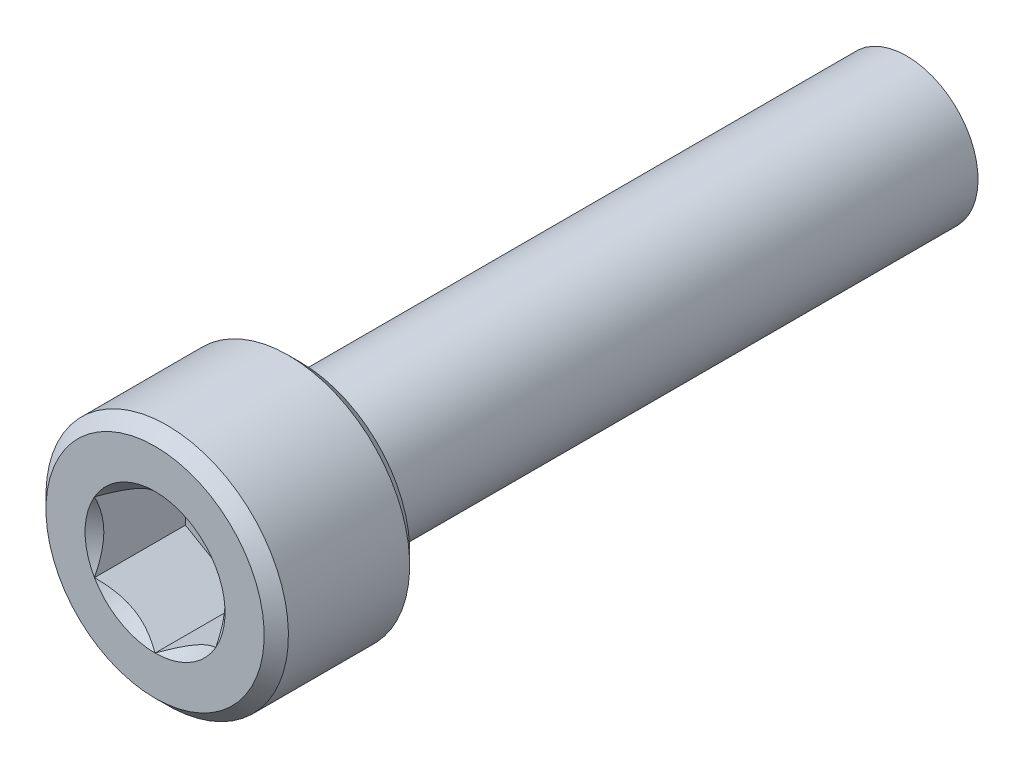
ISO-10303-21;
HEADER;
FILE_DESCRIPTION(('STEP AP214'),'2;1');
FILE_NAME('part.step','',(''),(''),'','','');
FILE_SCHEMA(('AUTOMOTIVE_DESIGN { 1 0 10303 214 1 1 1 1 }'));
ENDSEC;
DATA;
#1=APPLICATION_CONTEXT('core data for automotive mechanical design processes');
#2=APPLICATION_PROTOCOL_DEFINITION('international standard','automotive_design',2000,#1);
#3=PRODUCT_CONTEXT('',#1,'mechanical');
#4=PRODUCT('Part','Part','',(#3));
#5=PRODUCT_RELATED_PRODUCT_CATEGORY('part','',(#4));
#6=PRODUCT_DEFINITION_FORMATION('','',#4);
#7=PRODUCT_DEFINITION_CONTEXT('part definition',#1,'design');
#8=PRODUCT_DEFINITION('design','',#6,#7);
#9=PRODUCT_DEFINITION_SHAPE('','',#8);
#10=(LENGTH_UNIT() NAMED_UNIT(*) SI_UNIT(.MILLI.,.METRE.));
#11=(NAMED_UNIT(*) PLANE_ANGLE_UNIT() SI_UNIT($,.RADIAN.));
#12=(NAMED_UNIT(*) SI_UNIT($,.STERADIAN.) SOLID_ANGLE_UNIT());
#13=UNCERTAINTY_MEASURE_WITH_UNIT(LENGTH_MEASURE(1.E-05),#10,'distance_accuracy_value','');
#14=(GEOMETRIC_REPRESENTATION_CONTEXT(3) GLOBAL_UNCERTAINTY_ASSIGNED_CONTEXT((#13)) GLOBAL_UNIT_ASSIGNED_CONTEXT((#10,
#11,#12)) REPRESENTATION_CONTEXT('',''));
#15=CARTESIAN_POINT('',(0.,0.,0.));
#16=DIRECTION('',(0.,0.,1.));
#17=DIRECTION('',(1.,0.,0.));
#18=AXIS2_PLACEMENT_3D('',#15,#16,#17);
#19=CARTESIAN_POINT('',(2.5,-4.33012701892219,2.25));
#20=DIRECTION('',(0.,0.,1.));
#21=DIRECTION('',(0.,-1.,0.));
#22=AXIS2_PLACEMENT_3D('',#19,#20,#21);
#23=PLANE('',#22);
#24=DIRECTION('',(-0.866025403784439,-0.5,0.));
#25=VECTOR('',#24,1.);
#26=CARTESIAN_POINT('',(0.,2.88675134594813,2.25));
#27=LINE('',#26,#25);
#28=CARTESIAN_POINT('',(0.,2.88675134594813,2.25));
#29=VERTEX_POINT('',#28);
#30=CARTESIAN_POINT('',(-2.5,1.44337567297407,2.25));
#31=VERTEX_POINT('',#30);
#32=EDGE_CURVE('E82',#29,#31,#27,.T.);
#33=ORIENTED_EDGE('',*,*,#32,.T.);
#34=DIRECTION('',(0.,-1.,0.));
#35=VECTOR('',#34,1.);
#36=CARTESIAN_POINT('',(-2.5,1.44337567297407,2.25));
#37=LINE('',#36,#35);
#38=CARTESIAN_POINT('',(-2.5,-1.44337567297406,2.25));
#39=VERTEX_POINT('',#38);
#40=EDGE_CURVE('E84',#31,#39,#37,.T.);
#41=ORIENTED_EDGE('',*,*,#40,.T.);
#42=DIRECTION('',(0.866025403784439,-0.5,0.));
#43=VECTOR('',#42,1.);
#44=CARTESIAN_POINT('',(-2.5,-1.44337567297406,2.25));
#45=LINE('',#44,#43);
#46=CARTESIAN_POINT('',(0.,-2.88675134594813,2.25));
#47=VERTEX_POINT('',#46);
#48=EDGE_CURVE('E85',#39,#47,#45,.T.);
#49=ORIENTED_EDGE('',*,*,#48,.T.);
#50=DIRECTION('',(0.866025403784439,0.5,0.));
#51=VECTOR('',#50,1.);
#52=CARTESIAN_POINT('',(0.,-2.88675134594813,2.25));
#53=LINE('',#52,#51);
#54=CARTESIAN_POINT('',(2.5,-1.44337567297406,2.25));
#55=VERTEX_POINT('',#54);
#56=EDGE_CURVE('E71',#47,#55,#53,.T.);
#57=ORIENTED_EDGE('',*,*,#56,.T.);
#58=DIRECTION('',(0.,1.,0.));
#59=VECTOR('',#58,1.);
#60=CARTESIAN_POINT('',(2.5,-1.44337567297406,2.25));
#61=LINE('',#60,#59);
#62=CARTESIAN_POINT('',(2.5,1.44337567297407,2.25));
#63=VERTEX_POINT('',#62);
#64=EDGE_CURVE('E110',#55,#63,#61,.T.);
#65=ORIENTED_EDGE('',*,*,#64,.T.);
#66=DIRECTION('',(-0.866025403784439,0.5,0.));
#67=VECTOR('',#66,1.);
#68=CARTESIAN_POINT('',(2.5,1.44337567297407,2.25));
#69=LINE('',#68,#67);
#70=EDGE_CURVE('E115',#63,#29,#69,.T.);
#71=ORIENTED_EDGE('',*,*,#70,.T.);
#72=EDGE_LOOP('',(#33,#41,#49,#57,#65,#71));
#73=FACE_BOUND('',#72,.T.);
#74=ADVANCED_FACE('F16',(#73),#23,.T.);
#75=CARTESIAN_POINT('',(-2.5,-1.44337567297406,2.25));
#76=DIRECTION('',(-0.5,-0.866025403784439,0.));
#77=DIRECTION('',(0.866025403784439,-0.5,0.));
#78=AXIS2_PLACEMENT_3D('',#75,#76,#77);
#79=PLANE('',#78);
#80=CARTESIAN_POINT('',(-2.50000000000478,-1.44337567296488,5.99999999997284));
#81=CARTESIAN_POINT('',(-2.41407377906344,-1.49298519975992,5.95043808245741));
#82=CARTESIAN_POINT('',(-2.32671086994276,-1.54342419885962,5.90378750042485));
#83=CARTESIAN_POINT('',(-2.14856893286567,-1.64627449418629,5.8183722762495));
#84=CARTESIAN_POINT('',(-2.05777297285882,-1.69869556613711,5.77965514357985));
#85=CARTESIAN_POINT('',(-1.87468737313266,-1.80440008642343,5.71333243481046));
#86=CARTESIAN_POINT('',(-1.78244433466394,-1.85765662951433,5.68556020407587));
#87=CARTESIAN_POINT('',(-1.59592809138011,-1.96534183278258,5.64277179301007));
#88=CARTESIAN_POINT('',(-1.50166058027178,-2.01976720569677,5.62772368472119));
#89=CARTESIAN_POINT('',(-1.33918618210886,-2.11357184321254,5.61414605045882));
#90=CARTESIAN_POINT('',(-1.27118904996239,-2.15283000576143,5.61213672815934));
#91=CARTESIAN_POINT('',(-1.13530603995205,-2.2312820981692,5.61552620020698));
#92=CARTESIAN_POINT('',(-1.06742020943239,-2.27047600069389,5.620927591165));
#93=CARTESIAN_POINT('',(-0.932289663227805,-2.34849365792084,5.63883111085846));
#94=CARTESIAN_POINT('',(-0.865045749955355,-2.38731694935006,5.65134117856481));
#95=CARTESIAN_POINT('',(-0.731720772442206,-2.46429216100698,5.68277536815797));
#96=CARTESIAN_POINT('',(-0.66563961942911,-2.50244413248745,5.70169899813869));
#97=CARTESIAN_POINT('',(-0.496416901917538,-2.60014491399575,5.75786430114282));
#98=CARTESIAN_POINT('',(-0.394323538956246,-2.65908854458393,5.79933497180169));
#99=CARTESIAN_POINT('',(-0.244203096422894,-2.74576062249143,5.86934112808069));
#100=CARTESIAN_POINT('',(-0.194731548971638,-2.77432303372964,5.89393775594674));
#101=CARTESIAN_POINT('',(-0.0967044691439402,-2.83091899465603,5.94537285125215));
#102=CARTESIAN_POINT('',(-0.0481483974394195,-2.85895285572543,5.9722099447588));
#103=CARTESIAN_POINT('',(8.22878246257458E-12,-2.88675134595287,5.99999999997017));
#104=B_SPLINE_CURVE_WITH_KNOTS('',3,(#80,#81,#82,#83,#84,#85,#86,#87,#88,#89,#90,#91,#92,#93,
#94,#95,#96,#97,#98,#99,#100,#101,#102,#103),.UNSPECIFIED.,.F.,.F.,(4,2,2,2,2,2,2,2,2,2,2,4),
(0.,0.332957366453414,0.667853853669039,0.997433317041697,1.32618330926339,1.56147590696143,
1.79685096897262,2.0324894159688,2.26810979410381,2.6422318258904,2.82878537250701,
3.01522534660843),.UNSPECIFIED.);
#105=CARTESIAN_POINT('',(-2.50000000000431,-1.44337567297655,5.9999999999704));
#106=VERTEX_POINT('',#105);
#107=CARTESIAN_POINT('',(-1.2122602004148E-12,-2.8867513459538,5.9999999999711));
#108=VERTEX_POINT('',#107);
#109=EDGE_CURVE('E19',#106,#108,#104,.T.);
#110=ORIENTED_EDGE('',*,*,#109,.T.);
#111=DIRECTION('',(0.,0.,1.));
#112=VECTOR('',#111,1.);
#113=CARTESIAN_POINT('',(0.,-2.88675134594813,2.25));
#114=LINE('',#113,#112);
#115=EDGE_CURVE('E90',#108,#47,#114,.F.);
#116=ORIENTED_EDGE('',*,*,#115,.T.);
#117=ORIENTED_EDGE('',*,*,#48,.F.);
#118=DIRECTION('',(0.,0.,1.));
#119=VECTOR('',#118,1.);
#120=CARTESIAN_POINT('',(-2.5,-1.44337567297406,2.25));
#121=LINE('',#120,#119);
#122=EDGE_CURVE('E58',#39,#106,#121,.T.);
#123=ORIENTED_EDGE('',*,*,#122,.T.);
#124=EDGE_LOOP('',(#110,#116,#117,#123));
#125=FACE_BOUND('',#124,.T.);
#126=ADVANCED_FACE('F89',(#125),#79,.F.);
#127=CARTESIAN_POINT('',(-2.5,1.44337567297407,2.25));
#128=DIRECTION('',(-1.,0.,0.));
#129=DIRECTION('',(0.,-1.,0.));
#130=AXIS2_PLACEMENT_3D('',#127,#128,#129);
#131=PLANE('',#130);
#132=CARTESIAN_POINT('',(-2.49999999999444,1.4433756729828,5.99999999997284));
#133=CARTESIAN_POINT('',(-2.499999999998,1.3441566194114,5.95043808245644));
#134=CARTESIAN_POINT('',(-2.49999999999946,1.24327862122713,5.90378750042239));
#135=CARTESIAN_POINT('',(-2.50000000000054,1.03757803060085,5.81837227624268));
#136=CARTESIAN_POINT('',(-2.50000000000014,0.932735886711096,5.77965514357014));
#137=CARTESIAN_POINT('',(-2.49999999999986,0.721326846162478,5.7133324347933));
#138=CARTESIAN_POINT('',(-2.49999999999996,0.614813759992766,5.68556020405418));
#139=CARTESIAN_POINT('',(-2.50000000000004,0.399443353479625,5.64277179297774));
#140=CARTESIAN_POINT('',(-2.50000000000001,0.290592607662495,5.62772368468276));
#141=CARTESIAN_POINT('',(-2.49999999999999,0.10298333265714,5.61414605040953));
#142=CARTESIAN_POINT('',(-2.5,0.0244670075745337,5.61213672810486));
#143=CARTESIAN_POINT('',(-2.5,-0.132437177211233,5.61552620014042));
#144=CARTESIAN_POINT('',(-2.5,-0.210824982246007,5.62092759109157));
#145=CARTESIAN_POINT('',(-2.5,-0.366860296671375,5.63883111077006));
#146=CARTESIAN_POINT('',(-2.5,-0.444506879515861,5.65134117846832));
#147=CARTESIAN_POINT('',(-2.5,-0.598457302802447,5.68277536804459));
#148=CARTESIAN_POINT('',(-2.5,-0.67476124575008,5.7016989980165));
#149=CARTESIAN_POINT('',(-2.5,-0.87016280881075,5.75786430101982));
#150=CARTESIAN_POINT('',(-2.5,-0.988050070042253,5.79933497169557));
#151=CARTESIAN_POINT('',(-2.5,-1.16139422593618,5.86934112800866));
#152=CARTESIAN_POINT('',(-2.5,-1.21851904843836,5.89393775588756));
#153=CARTESIAN_POINT('',(-2.5,-1.3317109703414,5.94537285122098));
#154=CARTESIAN_POINT('',(-2.5,-1.38777869250468,5.97220994474277));
#155=CARTESIAN_POINT('',(-2.5,-1.44337567298356,5.99999999997017));
#156=B_SPLINE_CURVE_WITH_KNOTS('',3,(#132,#133,#134,#135,#136,#137,#138,#139,#140,#141,#142,
#143,#144,#145,#146,#147,#148,#149,#150,#151,#152,#153,#154,#155),.UNSPECIFIED.,.F.,.F.,(4,2,2,
2,2,2,2,2,2,2,2,4),(0.,0.332957366421071,0.667853853604345,0.997433316945952,1.32618330913662,
1.56147590678967,1.79685096875581,2.03248941570688,2.26810979379679,2.64223182575469,
2.8287853724575,3.01522534664473),.UNSPECIFIED.);
#157=CARTESIAN_POINT('',(-2.50000000000431,1.44337567297656,5.9999999999704));
#158=VERTEX_POINT('',#157);
#159=EDGE_CURVE('E94',#158,#106,#156,.T.);
#160=ORIENTED_EDGE('',*,*,#159,.T.);
#161=ORIENTED_EDGE('',*,*,#122,.F.);
#162=ORIENTED_EDGE('',*,*,#40,.F.);
#163=DIRECTION('',(0.,0.,1.));
#164=VECTOR('',#163,1.);
#165=CARTESIAN_POINT('',(-2.5,1.44337567297407,2.25));
#166=LINE('',#165,#164);
#167=EDGE_CURVE('E96',#31,#158,#166,.T.);
#168=ORIENTED_EDGE('',*,*,#167,.T.);
#169=EDGE_LOOP('',(#160,#161,#162,#168));
#170=FACE_BOUND('',#169,.T.);
#171=ADVANCED_FACE('F92',(#170),#131,.F.);
#172=CARTESIAN_POINT('',(0.,2.88675134594813,2.25));
#173=DIRECTION('',(-0.5,0.866025403784439,0.));
#174=DIRECTION('',(-0.866025403784439,-0.5,0.));
#175=AXIS2_PLACEMENT_3D('',#172,#173,#174);
#176=PLANE('',#175);
#177=CARTESIAN_POINT('',(1.03437304235675E-11,2.88675134594768,5.99999999997284));
#178=CARTESIAN_POINT('',(-0.0859262209345602,2.8371418191588,5.95043808245742));
#179=CARTESIAN_POINT('',(-0.173289130056698,2.78670282006164,5.90378750042485));
#180=CARTESIAN_POINT('',(-0.351431067134871,2.68385252473684,5.81837227624951));
#181=CARTESIAN_POINT('',(-0.442227027141324,2.63143145278532,5.77965514357985));
#182=CARTESIAN_POINT('',(-0.6253126268672,2.52572693249852,5.71333243481047));
#183=CARTESIAN_POINT('',(-0.717555665336021,2.47247038940779,5.68556020407588));
#184=CARTESIAN_POINT('',(-0.904071908619929,2.36478518613968,5.64277179301007));
#185=CARTESIAN_POINT('',(-0.998339419728224,2.31035981322544,5.6277236847212));
#186=CARTESIAN_POINT('',(-1.16081381789113,2.21655517570964,5.61414605045883));
#187=CARTESIAN_POINT('',(-1.22881095003761,2.17729701316076,5.61213672815934));
#188=CARTESIAN_POINT('',(-1.36469396004795,2.09884492075299,5.61552620020698));
#189=CARTESIAN_POINT('',(-1.43257979056761,2.0596510182283,5.620927591165));
#190=CARTESIAN_POINT('',(-1.56771033677219,1.98163336100134,5.63883111085846));
#191=CARTESIAN_POINT('',(-1.63495425004464,1.94281006957213,5.65134117856481));
#192=CARTESIAN_POINT('',(-1.76827922755779,1.86583485791521,5.68277536815798));
#193=CARTESIAN_POINT('',(-1.83436038057089,1.82768288643474,5.7016989981387));
#194=CARTESIAN_POINT('',(-2.00358309808246,1.72998210492644,5.75786430114282));
#195=CARTESIAN_POINT('',(-2.10567646104375,1.67103847433826,5.79933497180169));
#196=CARTESIAN_POINT('',(-2.2557969035771,1.58436639643077,5.8693411280807));
#197=CARTESIAN_POINT('',(-2.30526845102836,1.55580398519256,5.89393775594674));
#198=CARTESIAN_POINT('',(-2.40329553085606,1.49920802426616,5.94537285125216));
#199=CARTESIAN_POINT('',(-2.45185160256058,1.47117416319677,5.9722099447588));
#200=CARTESIAN_POINT('',(-2.50000000000822,1.44337567296932,5.99999999997017));
#201=B_SPLINE_CURVE_WITH_KNOTS('',3,(#177,#178,#179,#180,#181,#182,#183,#184,#185,#186,#187,
#188,#189,#190,#191,#192,#193,#194,#195,#196,#197,#198,#199,#200),.UNSPECIFIED.,.F.,.F.,(4,2,2,
2,2,2,2,2,2,2,2,4),(0.,0.332957366453413,0.667853853669037,0.997433317041695,1.32618330926339,
1.56147590696143,1.79685096897261,2.0324894159688,2.26810979410381,2.6422318258904,
2.828785372507,3.01522534660842),.UNSPECIFIED.);
#202=CARTESIAN_POINT('',(0.,2.88675134595311,5.9999999999704));
#203=VERTEX_POINT('',#202);
#204=EDGE_CURVE('E197',#203,#158,#201,.T.);
#205=ORIENTED_EDGE('',*,*,#204,.T.);
#206=ORIENTED_EDGE('',*,*,#167,.F.);
#207=ORIENTED_EDGE('',*,*,#32,.F.);
#208=DIRECTION('',(0.,0.,1.));
#209=VECTOR('',#208,1.);
#210=CARTESIAN_POINT('',(0.,2.88675134594813,2.25));
#211=LINE('',#210,#209);
#212=EDGE_CURVE('E112',#29,#203,#211,.T.);
#213=ORIENTED_EDGE('',*,*,#212,.T.);
#214=EDGE_LOOP('',(#205,#206,#207,#213));
#215=FACE_BOUND('',#214,.T.);
#216=ADVANCED_FACE('F207',(#215),#176,.F.);
#217=CARTESIAN_POINT('',(2.5,1.44337567297407,2.25));
#218=DIRECTION('',(0.5,0.866025403784439,0.));
#219=DIRECTION('',(-0.866025403784439,0.5,0.));
#220=AXIS2_PLACEMENT_3D('',#217,#218,#219);
#221=PLANE('',#220);
#222=CARTESIAN_POINT('',(2.50000000000478,1.44337567296489,5.99999999997284));
#223=CARTESIAN_POINT('',(2.41407377906344,1.49298519975993,5.95043808245742));
#224=CARTESIAN_POINT('',(2.32671086994276,1.54342419885963,5.90378750042486));
#225=CARTESIAN_POINT('',(2.14856893286567,1.6462744941863,5.81837227624951));
#226=CARTESIAN_POINT('',(2.05777297285882,1.69869556613712,5.77965514357985));
#227=CARTESIAN_POINT('',(1.87468737313266,1.80440008642344,5.71333243481047));
#228=CARTESIAN_POINT('',(1.78244433466394,1.85765662951434,5.68556020407588));
#229=CARTESIAN_POINT('',(1.59592809138011,1.96534183278259,5.64277179301007));
#230=CARTESIAN_POINT('',(1.50166058027179,2.01976720569678,5.6277236847212));
#231=CARTESIAN_POINT('',(1.33918618210886,2.11357184321255,5.61414605045883));
#232=CARTESIAN_POINT('',(1.2711890499624,2.15283000576144,5.61213672815935));
#233=CARTESIAN_POINT('',(1.13530603995205,2.23128209816921,5.61552620020699));
#234=CARTESIAN_POINT('',(1.06742020943239,2.2704760006939,5.62092759116501));
#235=CARTESIAN_POINT('',(0.932289663227807,2.34849365792085,5.63883111085847));
#236=CARTESIAN_POINT('',(0.865045749955358,2.38731694935007,5.65134117856482));
#237=CARTESIAN_POINT('',(0.731720772442207,2.46429216100699,5.68277536815798));
#238=CARTESIAN_POINT('',(0.665639619429111,2.50244413248746,5.7016989981387));
#239=CARTESIAN_POINT('',(0.49641690191754,2.60014491399576,5.75786430114283));
#240=CARTESIAN_POINT('',(0.394323538956249,2.65908854458394,5.7993349718017));
#241=CARTESIAN_POINT('',(0.244203096422899,2.74576062249143,5.8693411280807));
#242=CARTESIAN_POINT('',(0.194731548971643,2.77432303372964,5.89393775594674));
#243=CARTESIAN_POINT('',(0.0967044691439463,2.83091899465604,5.94537285125216));
#244=CARTESIAN_POINT('',(0.048148397439426,2.85895285572543,5.9722099447588));
#245=CARTESIAN_POINT('',(-8.22208739684531E-12,2.88675134595288,5.99999999997018));
#246=B_SPLINE_CURVE_WITH_KNOTS('',3,(#222,#223,#224,#225,#226,#227,#228,#229,#230,#231,#232,
#233,#234,#235,#236,#237,#238,#239,#240,#241,#242,#243,#244,#245),.UNSPECIFIED.,.F.,.F.,(4,2,2,
2,2,2,2,2,2,2,2,4),(0.,0.332957366453411,0.667853853669034,0.997433317041691,1.32618330926338,
1.56147590696142,1.79685096897261,2.03248941596879,2.26810979410381,2.64223182589039,
2.828785372507,3.01522534660841),.UNSPECIFIED.);
#247=CARTESIAN_POINT('',(2.50000000000431,1.44337567297656,5.9999999999704));
#248=VERTEX_POINT('',#247);
#249=EDGE_CURVE('E189',#248,#203,#246,.T.);
#250=ORIENTED_EDGE('',*,*,#249,.T.);
#251=ORIENTED_EDGE('',*,*,#212,.F.);
#252=ORIENTED_EDGE('',*,*,#70,.F.);
#253=DIRECTION('',(0.,0.,-1.));
#254=VECTOR('',#253,1.);
#255=CARTESIAN_POINT('',(2.5,1.44337567297407,2.25));
#256=LINE('',#255,#254);
#257=EDGE_CURVE('E107',#63,#248,#256,.F.);
#258=ORIENTED_EDGE('',*,*,#257,.T.);
#259=EDGE_LOOP('',(#250,#251,#252,#258));
#260=FACE_BOUND('',#259,.T.);
#261=ADVANCED_FACE('F203',(#260),#221,.F.);
#262=CARTESIAN_POINT('',(2.5,-1.44337567297406,2.25));
#263=DIRECTION('',(1.,0.,0.));
#264=DIRECTION('',(0.,0.,-1.));
#265=AXIS2_PLACEMENT_3D('',#262,#263,#264);
#266=PLANE('',#265);
#267=CARTESIAN_POINT('',(2.49999999999444,-1.44337567298279,5.99999999997284));
#268=CARTESIAN_POINT('',(2.499999999998,-1.3441566194114,5.95043808245644));
#269=CARTESIAN_POINT('',(2.49999999999946,-1.24327862122713,5.90378750042239));
#270=CARTESIAN_POINT('',(2.50000000000054,-1.03757803060085,5.81837227624268));
#271=CARTESIAN_POINT('',(2.50000000000014,-0.932735886711091,5.77965514357014));
#272=CARTESIAN_POINT('',(2.49999999999986,-0.721326846162473,5.7133324347933));
#273=CARTESIAN_POINT('',(2.49999999999996,-0.614813759992762,5.68556020405418));
#274=CARTESIAN_POINT('',(2.50000000000004,-0.399443353479622,5.64277179297774));
#275=CARTESIAN_POINT('',(2.50000000000001,-0.290592607662492,5.62772368468276));
#276=CARTESIAN_POINT('',(2.49999999999999,-0.102983332657137,5.61414605040954));
#277=CARTESIAN_POINT('',(2.5,-0.0244670075745308,5.61213672810486));
#278=CARTESIAN_POINT('',(2.5,0.132437177211236,5.61552620014043));
#279=CARTESIAN_POINT('',(2.5,0.21082498224601,5.62092759109157));
#280=CARTESIAN_POINT('',(2.5,0.366860296671379,5.63883111077006));
#281=CARTESIAN_POINT('',(2.5,0.444506879515865,5.65134117846832));
#282=CARTESIAN_POINT('',(2.5,0.598457302802451,5.68277536804459));
#283=CARTESIAN_POINT('',(2.5,0.674761245750083,5.7016989980165));
#284=CARTESIAN_POINT('',(2.5,0.870162808810754,5.75786430101983));
#285=CARTESIAN_POINT('',(2.5,0.988050070042257,5.79933497169558));
#286=CARTESIAN_POINT('',(2.5,1.16139422593619,5.86934112800866));
#287=CARTESIAN_POINT('',(2.5,1.21851904843837,5.89393775588756));
#288=CARTESIAN_POINT('',(2.5,1.33171097034141,5.94537285122098));
#289=CARTESIAN_POINT('',(2.5,1.38777869250468,5.97220994474277));
#290=CARTESIAN_POINT('',(2.5,1.44337567298357,5.99999999997018));
#291=B_SPLINE_CURVE_WITH_KNOTS('',3,(#267,#268,#269,#270,#271,#272,#273,#274,#275,#276,#277,
#278,#279,#280,#281,#282,#283,#284,#285,#286,#287,#288,#289,#290),.UNSPECIFIED.,.F.,.F.,(4,2,2,
2,2,2,2,2,2,2,2,4),(0.,0.33295736642107,0.667853853604343,0.997433316945949,1.32618330913661,
1.56147590678967,1.79685096875581,2.03248941570687,2.26810979379679,2.64223182575469,
2.8287853724575,3.01522534664473),.UNSPECIFIED.);
#292=CARTESIAN_POINT('',(2.50000000000431,-1.44337567297655,5.9999999999704));
#293=VERTEX_POINT('',#292);
#294=EDGE_CURVE('E159',#293,#248,#291,.T.);
#295=ORIENTED_EDGE('',*,*,#294,.T.);
#296=ORIENTED_EDGE('',*,*,#257,.F.);
#297=ORIENTED_EDGE('',*,*,#64,.F.);
#298=DIRECTION('',(0.,0.,1.));
#299=VECTOR('',#298,1.);
#300=CARTESIAN_POINT('',(2.5,-1.44337567297406,2.25));
#301=LINE('',#300,#299);
#302=EDGE_CURVE('E39',#55,#293,#301,.T.);
#303=ORIENTED_EDGE('',*,*,#302,.T.);
#304=EDGE_LOOP('',(#295,#296,#297,#303));
#305=FACE_BOUND('',#304,.T.);
#306=ADVANCED_FACE('F206',(#305),#266,.F.);
#307=CARTESIAN_POINT('',(0.,-2.88675134594813,2.25));
#308=DIRECTION('',(0.5,-0.866025403784439,0.));
#309=DIRECTION('',(0.866025403784439,0.5,0.));
#310=AXIS2_PLACEMENT_3D('',#307,#308,#309);
#311=PLANE('',#310);
#312=CARTESIAN_POINT('',(-1.03421625670786E-11,-2.88675134594768,5.99999999997284));
#313=CARTESIAN_POINT('',(0.0859262209345617,-2.8371418191588,5.95043808245742));
#314=CARTESIAN_POINT('',(0.1732891300567,-2.78670282006164,5.90378750042485));
#315=CARTESIAN_POINT('',(0.351431067134872,-2.68385252473684,5.81837227624951));
#316=CARTESIAN_POINT('',(0.442227027141325,-2.63143145278532,5.77965514357985));
#317=CARTESIAN_POINT('',(0.625312626867201,-2.52572693249852,5.71333243481047));
#318=CARTESIAN_POINT('',(0.717555665336022,-2.47247038940779,5.68556020407588));
#319=CARTESIAN_POINT('',(0.904071908619929,-2.36478518613968,5.64277179301007));
#320=CARTESIAN_POINT('',(0.998339419728224,-2.31035981322543,5.6277236847212));
#321=CARTESIAN_POINT('',(1.16081381789113,-2.21655517570964,5.61414605045883));
#322=CARTESIAN_POINT('',(1.2288109500376,-2.17729701316076,5.61213672815935));
#323=CARTESIAN_POINT('',(1.36469396004795,-2.09884492075299,5.61552620020698));
#324=CARTESIAN_POINT('',(1.43257979056761,-2.0596510182283,5.62092759116501));
#325=CARTESIAN_POINT('',(1.56771033677219,-1.98163336100134,5.63883111085846));
#326=CARTESIAN_POINT('',(1.63495425004464,-1.94281006957213,5.65134117856481));
#327=CARTESIAN_POINT('',(1.76827922755779,-1.86583485791521,5.68277536815798));
#328=CARTESIAN_POINT('',(1.83436038057089,-1.82768288643474,5.7016989981387));
#329=CARTESIAN_POINT('',(2.00358309808246,-1.72998210492644,5.75786430114283));
#330=CARTESIAN_POINT('',(2.10567646104375,-1.67103847433826,5.7993349718017));
#331=CARTESIAN_POINT('',(2.25579690357711,-1.58436639643076,5.8693411280807));
#332=CARTESIAN_POINT('',(2.30526845102836,-1.55580398519255,5.89393775594674));
#333=CARTESIAN_POINT('',(2.40329553085606,-1.49920802426616,5.94537285125216));
#334=CARTESIAN_POINT('',(2.45185160256058,-1.47117416319676,5.9722099447588));
#335=CARTESIAN_POINT('',(2.50000000000823,-1.44337567296932,5.99999999997018));
#336=B_SPLINE_CURVE_WITH_KNOTS('',3,(#312,#313,#314,#315,#316,#317,#318,#319,#320,#321,#322,
#323,#324,#325,#326,#327,#328,#329,#330,#331,#332,#333,#334,#335),.UNSPECIFIED.,.F.,.F.,(4,2,2,
2,2,2,2,2,2,2,2,4),(0.,0.332957366453413,0.667853853669036,0.997433317041693,1.32618330926338,
1.56147590696143,1.79685096897261,2.0324894159688,2.26810979410381,2.6422318258904,
2.828785372507,3.01522534660842),.UNSPECIFIED.);
#337=EDGE_CURVE('E151',#108,#293,#336,.T.);
#338=ORIENTED_EDGE('',*,*,#337,.T.);
#339=ORIENTED_EDGE('',*,*,#302,.F.);
#340=ORIENTED_EDGE('',*,*,#56,.F.);
#341=ORIENTED_EDGE('',*,*,#115,.F.);
#342=EDGE_LOOP('',(#338,#339,#340,#341));
#343=FACE_BOUND('',#342,.T.);
#344=ADVANCED_FACE('F167',(#343),#311,.F.);
#345=CARTESIAN_POINT('',(0.,0.,5.99999999997181));
#346=DIRECTION('',(0.,0.,1.));
#347=DIRECTION('',(0.,-1.,0.));
#348=AXIS2_PLACEMENT_3D('',#345,#346,#347);
#349=CONICAL_SURFACE('',#348,2.88675134595451,0.785398163397448);
#350=ORIENTED_EDGE('',*,*,#109,.F.);
#351=CARTESIAN_POINT('',(0.,0.,5.99999999997181));
#352=DIRECTION('',(0.,0.,1.));
#353=DIRECTION('',(0.,-1.,0.));
#354=AXIS2_PLACEMENT_3D('',#351,#352,#353);
#355=CIRCLE('',#354,2.88675134595451);
#356=EDGE_CURVE('E148',#108,#106,#355,.F.);
#357=ORIENTED_EDGE('',*,*,#356,.F.);
#358=EDGE_LOOP('',(#350,#357));
#359=FACE_BOUND('',#358,.T.);
#360=ADVANCED_FACE('F224',(#359),#349,.F.);
#361=CARTESIAN_POINT('',(0.,0.,5.99999999997181));
#362=DIRECTION('',(0.,0.,1.));
#363=DIRECTION('',(0.,-1.,0.));
#364=AXIS2_PLACEMENT_3D('',#361,#362,#363);
#365=CONICAL_SURFACE('',#364,2.88675134595451,0.785398163324398);
#366=CARTESIAN_POINT('',(0.,0.,5.99999999997181));
#367=DIRECTION('',(0.,0.,1.));
#368=DIRECTION('',(0.,-1.,0.));
#369=AXIS2_PLACEMENT_3D('',#366,#367,#368);
#370=CIRCLE('',#369,2.88675134595451);
#371=EDGE_CURVE('E145',#106,#158,#370,.F.);
#372=ORIENTED_EDGE('',*,*,#371,.F.);
#373=ORIENTED_EDGE('',*,*,#159,.F.);
#374=EDGE_LOOP('',(#372,#373));
#375=FACE_BOUND('',#374,.T.);
#376=ADVANCED_FACE('F221',(#375),#365,.F.);
#377=CARTESIAN_POINT('',(0.,0.,5.99999999997181));
#378=DIRECTION('',(0.,0.,1.));
#379=DIRECTION('',(0.,-1.,0.));
#380=AXIS2_PLACEMENT_3D('',#377,#378,#379);
#381=CONICAL_SURFACE('',#380,2.88675134595451,0.785398163397448);
#382=ORIENTED_EDGE('',*,*,#204,.F.);
#383=CARTESIAN_POINT('',(0.,0.,5.99999999997181));
#384=DIRECTION('',(0.,0.,1.));
#385=DIRECTION('',(0.,-1.,0.));
#386=AXIS2_PLACEMENT_3D('',#383,#384,#385);
#387=CIRCLE('',#386,2.88675134595451);
#388=EDGE_CURVE('E142',#158,#203,#387,.F.);
#389=ORIENTED_EDGE('',*,*,#388,.F.);
#390=EDGE_LOOP('',(#382,#389));
#391=FACE_BOUND('',#390,.T.);
#392=ADVANCED_FACE('F185',(#391),#381,.F.);
#393=CARTESIAN_POINT('',(0.,0.,5.99999999997181));
#394=DIRECTION('',(0.,0.,1.));
#395=DIRECTION('',(0.,-1.,0.));
#396=AXIS2_PLACEMENT_3D('',#393,#394,#395);
#397=CONICAL_SURFACE('',#396,2.88675134595451,0.785398163397448);
#398=ORIENTED_EDGE('',*,*,#249,.F.);
#399=CARTESIAN_POINT('',(0.,0.,5.99999999997181));
#400=DIRECTION('',(0.,0.,1.));
#401=DIRECTION('',(0.,-1.,0.));
#402=AXIS2_PLACEMENT_3D('',#399,#400,#401);
#403=CIRCLE('',#402,2.88675134595451);
#404=EDGE_CURVE('E139',#203,#248,#403,.F.);
#405=ORIENTED_EDGE('',*,*,#404,.F.);
#406=EDGE_LOOP('',(#398,#405));
#407=FACE_BOUND('',#406,.T.);
#408=ADVANCED_FACE('F180',(#407),#397,.F.);
#409=CARTESIAN_POINT('',(0.,0.,5.99999999997181));
#410=DIRECTION('',(0.,0.,1.));
#411=DIRECTION('',(0.,-1.,0.));
#412=AXIS2_PLACEMENT_3D('',#409,#410,#411);
#413=CONICAL_SURFACE('',#412,2.88675134595451,0.785398163324398);
#414=ORIENTED_EDGE('',*,*,#294,.F.);
#415=CARTESIAN_POINT('',(0.,0.,5.99999999997181));
#416=DIRECTION('',(0.,0.,1.));
#417=DIRECTION('',(0.,-1.,0.));
#418=AXIS2_PLACEMENT_3D('',#415,#416,#417);
#419=CIRCLE('',#418,2.88675134595451);
#420=EDGE_CURVE('E136',#248,#293,#419,.F.);
#421=ORIENTED_EDGE('',*,*,#420,.F.);
#422=EDGE_LOOP('',(#414,#421));
#423=FACE_BOUND('',#422,.T.);
#424=ADVANCED_FACE('F174',(#423),#413,.F.);
#425=CARTESIAN_POINT('',(0.,0.,5.99999999997181));
#426=DIRECTION('',(0.,0.,1.));
#427=DIRECTION('',(0.,-1.,0.));
#428=AXIS2_PLACEMENT_3D('',#425,#426,#427);
#429=CONICAL_SURFACE('',#428,2.88675134595451,0.785398163397448);
#430=ORIENTED_EDGE('',*,*,#337,.F.);
#431=CARTESIAN_POINT('',(0.,0.,5.99999999997181));
#432=DIRECTION('',(0.,0.,1.));
#433=DIRECTION('',(0.,-1.,0.));
#434=AXIS2_PLACEMENT_3D('',#431,#432,#433);
#435=CIRCLE('',#434,2.88675134595451);
#436=EDGE_CURVE('E133',#293,#108,#435,.F.);
#437=ORIENTED_EDGE('',*,*,#436,.F.);
#438=EDGE_LOOP('',(#430,#437));
#439=FACE_BOUND('',#438,.T.);
#440=ADVANCED_FACE('F169',(#439),#429,.F.);
#441=CARTESIAN_POINT('',(0.,0.,6.));
#442=DIRECTION('',(0.,0.,1.));
#443=DIRECTION('',(0.,-1.,0.));
#444=AXIS2_PLACEMENT_3D('',#441,#442,#443);
#445=PLANE('',#444);
#446=ORIENTED_EDGE('',*,*,#420,.T.);
#447=ORIENTED_EDGE('',*,*,#436,.T.);
#448=ORIENTED_EDGE('',*,*,#356,.T.);
#449=ORIENTED_EDGE('',*,*,#371,.T.);
#450=ORIENTED_EDGE('',*,*,#388,.T.);
#451=ORIENTED_EDGE('',*,*,#404,.T.);
#452=EDGE_LOOP('',(#446,#447,#448,#449,#450,#451));
#453=FACE_BOUND('',#452,.T.);
#454=CARTESIAN_POINT('',(0.,0.,5.99999999997181));
#455=DIRECTION('',(0.,0.,-1.));
#456=DIRECTION('',(0.,1.,0.));
#457=AXIS2_PLACEMENT_3D('',#454,#455,#456);
#458=CIRCLE('',#457,4.50000000000728);
#459=CARTESIAN_POINT('',(0.,4.50000000000728,5.99999999997181));
#460=VERTEX_POINT('',#459);
#461=EDGE_CURVE('E129',#460,#460,#458,.T.);
#462=ORIENTED_EDGE('',*,*,#461,.F.);
#463=EDGE_LOOP('',(#462));
#464=FACE_BOUND('',#463,.T.);
#465=ADVANCED_FACE('F173',(#453,#464),#445,.T.);
#466=CARTESIAN_POINT('',(0.,0.,5.50000000004047));
#467=DIRECTION('',(0.,0.,-1.));
#468=DIRECTION('',(0.,1.,0.));
#469=AXIS2_PLACEMENT_3D('',#466,#467,#468);
#470=CONICAL_SURFACE('',#469,4.99999999993861,0.785398163397448);
#471=ORIENTED_EDGE('',*,*,#461,.T.);
#472=EDGE_LOOP('',(#471));
#473=FACE_BOUND('',#472,.T.);
#474=CARTESIAN_POINT('',(0.,0.,5.5));
#475=DIRECTION('',(0.,0.,-1.));
#476=DIRECTION('',(0.,1.,0.));
#477=AXIS2_PLACEMENT_3D('',#474,#475,#476);
#478=CIRCLE('',#477,5.);
#479=CARTESIAN_POINT('',(0.,5.,5.5));
#480=VERTEX_POINT('',#479);
#481=EDGE_CURVE('E132',#480,#480,#478,.T.);
#482=ORIENTED_EDGE('',*,*,#481,.F.);
#483=EDGE_LOOP('',(#482));
#484=FACE_BOUND('',#483,.T.);
#485=ADVANCED_FACE('F256',(#473,#484),#470,.T.);
#486=CARTESIAN_POINT('',(0.,0.,6.));
#487=DIRECTION('',(0.,0.,-1.));
#488=DIRECTION('',(0.,1.,0.));
#489=AXIS2_PLACEMENT_3D('',#486,#487,#488);
#490=CYLINDRICAL_SURFACE('',#489,5.);
#491=ORIENTED_EDGE('',*,*,#481,.T.);
#492=EDGE_LOOP('',(#491));
#493=FACE_BOUND('',#492,.T.);
#494=CARTESIAN_POINT('',(0.,0.,0.499999999988177));
#495=DIRECTION('',(0.,0.,1.));
#496=DIRECTION('',(-1.,0.,0.));
#497=AXIS2_PLACEMENT_3D('',#494,#495,#496);
#498=CIRCLE('',#497,4.99999999999545);
#499=CARTESIAN_POINT('',(-4.99999999999545,0.,0.499999999988177));
#500=VERTEX_POINT('',#499);
#501=EDGE_CURVE('E128',#500,#500,#498,.F.);
#502=ORIENTED_EDGE('',*,*,#501,.F.);
#503=EDGE_LOOP('',(#502));
#504=FACE_BOUND('',#503,.T.);
#505=ADVANCED_FACE('F253',(#493,#504),#490,.T.);
#506=CARTESIAN_POINT('',(0.,0.,0.49999999987449));
#507=DIRECTION('',(0.,0.,1.));
#508=DIRECTION('',(0.,-1.,0.));
#509=AXIS2_PLACEMENT_3D('',#506,#507,#508);
#510=CONICAL_SURFACE('',#509,4.99999999988177,0.785398163397448);
#511=CARTESIAN_POINT('',(0.,0.,0.));
#512=DIRECTION('',(0.,0.,1.));
#513=DIRECTION('',(0.,-1.,0.));
#514=AXIS2_PLACEMENT_3D('',#511,#512,#513);
#515=CIRCLE('',#514,4.50000000000728);
#516=CARTESIAN_POINT('',(0.,-4.50000000000728,0.));
#517=VERTEX_POINT('',#516);
#518=EDGE_CURVE('E125',#517,#517,#515,.T.);
#519=ORIENTED_EDGE('',*,*,#518,.T.);
#520=EDGE_LOOP('',(#519));
#521=FACE_BOUND('',#520,.T.);
#522=ORIENTED_EDGE('',*,*,#501,.T.);
#523=EDGE_LOOP('',(#522));
#524=FACE_BOUND('',#523,.T.);
#525=ADVANCED_FACE('F249',(#521,#524),#510,.T.);
#526=CARTESIAN_POINT('',(0.,0.,-25.));
#527=DIRECTION('',(0.,0.,-1.));
#528=DIRECTION('',(0.,1.,0.));
#529=AXIS2_PLACEMENT_3D('',#526,#527,#528);
#530=PLANE('',#529);
#531=CARTESIAN_POINT('',(0.,0.,-25.));
#532=DIRECTION('',(0.,0.,-1.));
#533=DIRECTION('',(0.,1.,0.));
#534=AXIS2_PLACEMENT_3D('',#531,#532,#533);
#535=CIRCLE('',#534,2.942);
#536=CARTESIAN_POINT('',(0.,2.942,-25.));
#537=VERTEX_POINT('',#536);
#538=EDGE_CURVE('E30',#537,#537,#535,.F.);
#539=ORIENTED_EDGE('',*,*,#538,.F.);
#540=EDGE_LOOP('',(#539));
#541=FACE_BOUND('',#540,.T.);
#542=ADVANCED_FACE('F242',(#541),#530,.T.);
#543=CARTESIAN_POINT('',(0.,0.,0.));
#544=DIRECTION('',(0.,0.,1.));
#545=DIRECTION('',(0.,-1.,0.));
#546=AXIS2_PLACEMENT_3D('',#543,#544,#545);
#547=PLANE('',#546);
#548=CARTESIAN_POINT('',(0.,0.,0.));
#549=DIRECTION('',(0.,0.,-1.));
#550=DIRECTION('',(0.,1.,0.));
#551=AXIS2_PLACEMENT_3D('',#548,#549,#550);
#552=CIRCLE('',#551,2.942);
#553=CARTESIAN_POINT('',(0.,2.942,0.));
#554=VERTEX_POINT('',#553);
#555=EDGE_CURVE('E11',#554,#554,#552,.T.);
#556=ORIENTED_EDGE('',*,*,#555,.F.);
#557=EDGE_LOOP('',(#556));
#558=FACE_BOUND('',#557,.T.);
#559=ORIENTED_EDGE('',*,*,#518,.F.);
#560=EDGE_LOOP('',(#559));
#561=FACE_BOUND('',#560,.T.);
#562=ADVANCED_FACE('F236',(#558,#561),#547,.F.);
#563=CARTESIAN_POINT('',(0.,0.,-30.));
#564=DIRECTION('',(0.,0.,-1.));
#565=DIRECTION('',(0.,1.,0.));
#566=AXIS2_PLACEMENT_3D('',#563,#564,#565);
#567=CYLINDRICAL_SURFACE('',#566,2.942);
#568=ORIENTED_EDGE('',*,*,#555,.T.);
#569=EDGE_LOOP('',(#568));
#570=FACE_BOUND('',#569,.T.);
#571=ORIENTED_EDGE('',*,*,#538,.T.);
#572=EDGE_LOOP('',(#571));
#573=FACE_BOUND('',#572,.T.);
#574=ADVANCED_FACE('F234',(#570,#573),#567,.T.);
#575=CLOSED_SHELL('',(#74,#126,#171,#216,#261,#306,#344,#360,#376,#392,#408,#424,#440,#465,#485,
#505,#525,#542,#562,#574));
#576=MANIFOLD_SOLID_BREP('B1',#575);
#577=ADVANCED_BREP_SHAPE_REPRESENTATION('',(#18,#576),#14);
#578=SHAPE_DEFINITION_REPRESENTATION(#9,#577);
ENDSEC;
END-ISO-10303-21;
